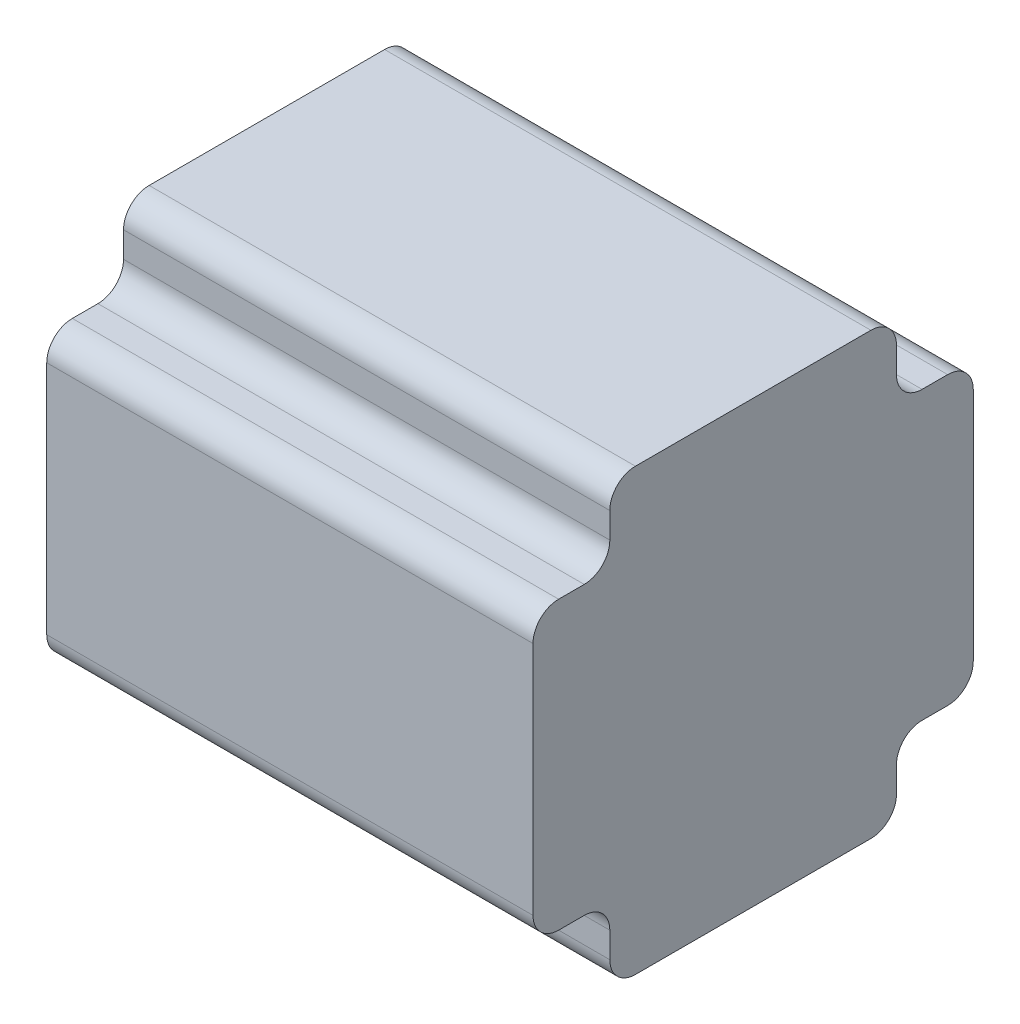
ISO-10303-21;
HEADER;
FILE_DESCRIPTION(('STEP AP214'),'2;1');
FILE_NAME('part.step','',(''),(''),'','','');
FILE_SCHEMA(('AUTOMOTIVE_DESIGN { 1 0 10303 214 1 1 1 1 }'));
ENDSEC;
DATA;
#1=APPLICATION_CONTEXT('core data for automotive mechanical design processes');
#2=APPLICATION_PROTOCOL_DEFINITION('international standard','automotive_design',2000,#1);
#3=PRODUCT_CONTEXT('',#1,'mechanical');
#4=PRODUCT('Part','Part','',(#3));
#5=PRODUCT_RELATED_PRODUCT_CATEGORY('part','',(#4));
#6=PRODUCT_DEFINITION_FORMATION('','',#4);
#7=PRODUCT_DEFINITION_CONTEXT('part definition',#1,'design');
#8=PRODUCT_DEFINITION('design','',#6,#7);
#9=PRODUCT_DEFINITION_SHAPE('','',#8);
#10=(LENGTH_UNIT() NAMED_UNIT(*) SI_UNIT(.MILLI.,.METRE.));
#11=(NAMED_UNIT(*) PLANE_ANGLE_UNIT() SI_UNIT($,.RADIAN.));
#12=(NAMED_UNIT(*) SI_UNIT($,.STERADIAN.) SOLID_ANGLE_UNIT());
#13=UNCERTAINTY_MEASURE_WITH_UNIT(LENGTH_MEASURE(1.E-05),#10,'distance_accuracy_value','');
#14=(GEOMETRIC_REPRESENTATION_CONTEXT(3) GLOBAL_UNCERTAINTY_ASSIGNED_CONTEXT((#13)) GLOBAL_UNIT_ASSIGNED_CONTEXT((#10,
#11,#12)) REPRESENTATION_CONTEXT('',''));
#15=CARTESIAN_POINT('',(0.,0.,0.));
#16=DIRECTION('',(0.,0.,1.));
#17=DIRECTION('',(1.,0.,0.));
#18=AXIS2_PLACEMENT_3D('',#15,#16,#17);
#19=CARTESIAN_POINT('',(95.,19.9999999999999,-81.));
#20=DIRECTION('',(-1.,0.,0.));
#21=DIRECTION('',(0.,0.,1.));
#22=AXIS2_PLACEMENT_3D('',#19,#20,#21);
#23=CYLINDRICAL_SURFACE('',#22,5.);
#24=CARTESIAN_POINT('',(0.,19.9999999999999,-81.));
#25=DIRECTION('',(1.,0.,0.));
#26=DIRECTION('',(0.,0.,-1.));
#27=AXIS2_PLACEMENT_3D('',#24,#25,#26);
#28=CIRCLE('',#27,5.);
#29=CARTESIAN_POINT('',(0.,14.9999999999999,-81.));
#30=VERTEX_POINT('',#29);
#31=CARTESIAN_POINT('',(0.,20.,-86.));
#32=VERTEX_POINT('',#31);
#33=EDGE_CURVE('E224',#30,#32,#28,.T.);
#34=ORIENTED_EDGE('',*,*,#33,.T.);
#35=DIRECTION('',(-1.,0.,0.));
#36=VECTOR('',#35,1.);
#37=CARTESIAN_POINT('',(95.,20.,-86.));
#38=LINE('',#37,#36);
#39=CARTESIAN_POINT('',(95.,20.,-86.));
#40=VERTEX_POINT('',#39);
#41=EDGE_CURVE('E11',#40,#32,#38,.T.);
#42=ORIENTED_EDGE('',*,*,#41,.F.);
#43=CARTESIAN_POINT('',(95.,19.9999999999999,-81.));
#44=DIRECTION('',(1.,0.,0.));
#45=DIRECTION('',(0.,0.,-1.));
#46=AXIS2_PLACEMENT_3D('',#43,#44,#45);
#47=CIRCLE('',#46,5.);
#48=CARTESIAN_POINT('',(95.,14.9999999999999,-81.));
#49=VERTEX_POINT('',#48);
#50=EDGE_CURVE('E270',#49,#40,#47,.T.);
#51=ORIENTED_EDGE('',*,*,#50,.F.);
#52=DIRECTION('',(-1.,0.,0.));
#53=VECTOR('',#52,1.);
#54=CARTESIAN_POINT('',(95.,14.9999999999999,-81.));
#55=LINE('',#54,#53);
#56=EDGE_CURVE('E220',#49,#30,#55,.T.);
#57=ORIENTED_EDGE('',*,*,#56,.T.);
#58=EDGE_LOOP('',(#34,#42,#51,#57));
#59=FACE_BOUND('',#58,.T.);
#60=ADVANCED_FACE('F32',(#59),#23,.T.);
#61=CARTESIAN_POINT('',(95.,20.,-86.));
#62=DIRECTION('',(0.,0.,1.));
#63=DIRECTION('',(1.,0.,0.));
#64=AXIS2_PLACEMENT_3D('',#61,#62,#63);
#65=PLANE('',#64);
#66=DIRECTION('',(0.,1.,0.));
#67=VECTOR('',#66,1.);
#68=CARTESIAN_POINT('',(0.,20.,-86.));
#69=LINE('',#68,#67);
#70=CARTESIAN_POINT('',(0.,65.9999999999999,-86.));
#71=VERTEX_POINT('',#70);
#72=EDGE_CURVE('E227',#32,#71,#69,.T.);
#73=ORIENTED_EDGE('',*,*,#72,.T.);
#74=DIRECTION('',(-1.,0.,0.));
#75=VECTOR('',#74,1.);
#76=CARTESIAN_POINT('',(95.,65.9999999999999,-86.));
#77=LINE('',#76,#75);
#78=CARTESIAN_POINT('',(95.,65.9999999999999,-86.));
#79=VERTEX_POINT('',#78);
#80=EDGE_CURVE('E40',#79,#71,#77,.T.);
#81=ORIENTED_EDGE('',*,*,#80,.F.);
#82=DIRECTION('',(0.,1.,0.));
#83=VECTOR('',#82,1.);
#84=CARTESIAN_POINT('',(95.,20.,-86.));
#85=LINE('',#84,#83);
#86=EDGE_CURVE('E139',#40,#79,#85,.T.);
#87=ORIENTED_EDGE('',*,*,#86,.F.);
#88=ORIENTED_EDGE('',*,*,#41,.T.);
#89=EDGE_LOOP('',(#73,#81,#87,#88));
#90=FACE_BOUND('',#89,.T.);
#91=ADVANCED_FACE('F408',(#90),#65,.F.);
#92=CARTESIAN_POINT('',(95.,65.9999999999999,-81.));
#93=DIRECTION('',(-1.,0.,0.));
#94=DIRECTION('',(0.,0.,1.));
#95=AXIS2_PLACEMENT_3D('',#92,#93,#94);
#96=CYLINDRICAL_SURFACE('',#95,5.);
#97=CARTESIAN_POINT('',(0.,65.9999999999999,-81.));
#98=DIRECTION('',(1.,0.,0.));
#99=DIRECTION('',(0.,0.,1.));
#100=AXIS2_PLACEMENT_3D('',#97,#98,#99);
#101=CIRCLE('',#100,5.);
#102=CARTESIAN_POINT('',(0.,70.9999999999999,-81.));
#103=VERTEX_POINT('',#102);
#104=EDGE_CURVE('E229',#71,#103,#101,.T.);
#105=ORIENTED_EDGE('',*,*,#104,.T.);
#106=DIRECTION('',(-1.,0.,0.));
#107=VECTOR('',#106,1.);
#108=CARTESIAN_POINT('',(95.,70.9999999999999,-81.));
#109=LINE('',#108,#107);
#110=CARTESIAN_POINT('',(95.,70.9999999999999,-81.));
#111=VERTEX_POINT('',#110);
#112=EDGE_CURVE('E325',#111,#103,#109,.T.);
#113=ORIENTED_EDGE('',*,*,#112,.F.);
#114=CARTESIAN_POINT('',(95.,65.9999999999999,-81.));
#115=DIRECTION('',(1.,0.,0.));
#116=DIRECTION('',(0.,0.,1.));
#117=AXIS2_PLACEMENT_3D('',#114,#115,#116);
#118=CIRCLE('',#117,5.);
#119=EDGE_CURVE('E333',#79,#111,#118,.T.);
#120=ORIENTED_EDGE('',*,*,#119,.F.);
#121=ORIENTED_EDGE('',*,*,#80,.T.);
#122=EDGE_LOOP('',(#105,#113,#120,#121));
#123=FACE_BOUND('',#122,.T.);
#124=ADVANCED_FACE('F331',(#123),#96,.T.);
#125=CARTESIAN_POINT('',(95.,70.9999999999999,-76.0000000000001));
#126=DIRECTION('',(0.,-1.,0.));
#127=DIRECTION('',(0.,0.,-1.));
#128=AXIS2_PLACEMENT_3D('',#125,#126,#127);
#129=PLANE('',#128);
#130=DIRECTION('',(0.,0.,1.));
#131=VECTOR('',#130,1.);
#132=CARTESIAN_POINT('',(0.,70.9999999999999,-76.0000000000001));
#133=LINE('',#132,#131);
#134=CARTESIAN_POINT('',(0.,70.9999999999999,-76.0000000000001));
#135=VERTEX_POINT('',#134);
#136=EDGE_CURVE('E231',#103,#135,#133,.T.);
#137=ORIENTED_EDGE('',*,*,#136,.T.);
#138=DIRECTION('',(-1.,0.,0.));
#139=VECTOR('',#138,1.);
#140=CARTESIAN_POINT('',(95.,70.9999999999999,-76.0000000000001));
#141=LINE('',#140,#139);
#142=CARTESIAN_POINT('',(95.,70.9999999999999,-76.0000000000001));
#143=VERTEX_POINT('',#142);
#144=EDGE_CURVE('E322',#143,#135,#141,.T.);
#145=ORIENTED_EDGE('',*,*,#144,.F.);
#146=DIRECTION('',(0.,0.,1.));
#147=VECTOR('',#146,1.);
#148=CARTESIAN_POINT('',(95.,70.9999999999999,-76.0000000000001));
#149=LINE('',#148,#147);
#150=EDGE_CURVE('E351',#111,#143,#149,.T.);
#151=ORIENTED_EDGE('',*,*,#150,.F.);
#152=ORIENTED_EDGE('',*,*,#112,.T.);
#153=EDGE_LOOP('',(#137,#145,#151,#152));
#154=FACE_BOUND('',#153,.T.);
#155=ADVANCED_FACE('F342',(#154),#129,.F.);
#156=CARTESIAN_POINT('',(95.,75.9999999999999,-76.));
#157=DIRECTION('',(-1.,0.,0.));
#158=DIRECTION('',(0.,0.,1.));
#159=AXIS2_PLACEMENT_3D('',#156,#157,#158);
#160=CYLINDRICAL_SURFACE('',#159,5.);
#161=CARTESIAN_POINT('',(0.,75.9999999999999,-76.));
#162=DIRECTION('',(-1.,0.,0.));
#163=DIRECTION('',(0.,0.,1.));
#164=AXIS2_PLACEMENT_3D('',#161,#162,#163);
#165=CIRCLE('',#164,5.);
#166=CARTESIAN_POINT('',(0.,75.9999999999999,-71.));
#167=VERTEX_POINT('',#166);
#168=EDGE_CURVE('E233',#135,#167,#165,.T.);
#169=ORIENTED_EDGE('',*,*,#168,.T.);
#170=DIRECTION('',(-1.,0.,0.));
#171=VECTOR('',#170,1.);
#172=CARTESIAN_POINT('',(95.,75.9999999999999,-71.));
#173=LINE('',#172,#171);
#174=CARTESIAN_POINT('',(95.,75.9999999999999,-71.));
#175=VERTEX_POINT('',#174);
#176=EDGE_CURVE('E319',#175,#167,#173,.T.);
#177=ORIENTED_EDGE('',*,*,#176,.F.);
#178=CARTESIAN_POINT('',(95.,75.9999999999999,-76.));
#179=DIRECTION('',(-1.,0.,0.));
#180=DIRECTION('',(0.,0.,1.));
#181=AXIS2_PLACEMENT_3D('',#178,#179,#180);
#182=CIRCLE('',#181,5.);
#183=EDGE_CURVE('E348',#143,#175,#182,.T.);
#184=ORIENTED_EDGE('',*,*,#183,.F.);
#185=ORIENTED_EDGE('',*,*,#144,.T.);
#186=EDGE_LOOP('',(#169,#177,#184,#185));
#187=FACE_BOUND('',#186,.T.);
#188=ADVANCED_FACE('F346',(#187),#160,.F.);
#189=CARTESIAN_POINT('',(95.,80.9999999999998,-71.));
#190=DIRECTION('',(0.,0.,1.));
#191=DIRECTION('',(1.,0.,0.));
#192=AXIS2_PLACEMENT_3D('',#189,#190,#191);
#193=PLANE('',#192);
#194=DIRECTION('',(0.,1.,0.));
#195=VECTOR('',#194,1.);
#196=CARTESIAN_POINT('',(0.,80.9999999999998,-71.));
#197=LINE('',#196,#195);
#198=CARTESIAN_POINT('',(0.,80.9999999999998,-71.));
#199=VERTEX_POINT('',#198);
#200=EDGE_CURVE('E235',#167,#199,#197,.T.);
#201=ORIENTED_EDGE('',*,*,#200,.T.);
#202=DIRECTION('',(-1.,0.,0.));
#203=VECTOR('',#202,1.);
#204=CARTESIAN_POINT('',(95.,80.9999999999998,-71.));
#205=LINE('',#204,#203);
#206=CARTESIAN_POINT('',(95.,80.9999999999998,-71.));
#207=VERTEX_POINT('',#206);
#208=EDGE_CURVE('E316',#207,#199,#205,.T.);
#209=ORIENTED_EDGE('',*,*,#208,.F.);
#210=DIRECTION('',(0.,1.,0.));
#211=VECTOR('',#210,1.);
#212=CARTESIAN_POINT('',(95.,80.9999999999998,-71.));
#213=LINE('',#212,#211);
#214=EDGE_CURVE('E350',#175,#207,#213,.T.);
#215=ORIENTED_EDGE('',*,*,#214,.F.);
#216=ORIENTED_EDGE('',*,*,#176,.T.);
#217=EDGE_LOOP('',(#201,#209,#215,#216));
#218=FACE_BOUND('',#217,.T.);
#219=ADVANCED_FACE('F421',(#218),#193,.F.);
#220=CARTESIAN_POINT('',(95.,80.9999999999999,-66.));
#221=DIRECTION('',(-1.,0.,0.));
#222=DIRECTION('',(0.,0.,1.));
#223=AXIS2_PLACEMENT_3D('',#220,#221,#222);
#224=CYLINDRICAL_SURFACE('',#223,5.);
#225=CARTESIAN_POINT('',(0.,80.9999999999999,-66.));
#226=DIRECTION('',(1.,0.,0.));
#227=DIRECTION('',(0.,0.,-1.));
#228=AXIS2_PLACEMENT_3D('',#225,#226,#227);
#229=CIRCLE('',#228,5.);
#230=CARTESIAN_POINT('',(0.,85.9999999999999,-66.));
#231=VERTEX_POINT('',#230);
#232=EDGE_CURVE('E237',#199,#231,#229,.T.);
#233=ORIENTED_EDGE('',*,*,#232,.T.);
#234=DIRECTION('',(-1.,0.,0.));
#235=VECTOR('',#234,1.);
#236=CARTESIAN_POINT('',(95.,85.9999999999999,-66.));
#237=LINE('',#236,#235);
#238=CARTESIAN_POINT('',(95.,85.9999999999999,-66.));
#239=VERTEX_POINT('',#238);
#240=EDGE_CURVE('E313',#239,#231,#237,.T.);
#241=ORIENTED_EDGE('',*,*,#240,.F.);
#242=CARTESIAN_POINT('',(95.,80.9999999999999,-66.));
#243=DIRECTION('',(1.,0.,0.));
#244=DIRECTION('',(0.,0.,-1.));
#245=AXIS2_PLACEMENT_3D('',#242,#243,#244);
#246=CIRCLE('',#245,5.);
#247=EDGE_CURVE('E353',#207,#239,#246,.T.);
#248=ORIENTED_EDGE('',*,*,#247,.F.);
#249=ORIENTED_EDGE('',*,*,#208,.T.);
#250=EDGE_LOOP('',(#233,#241,#248,#249));
#251=FACE_BOUND('',#250,.T.);
#252=ADVANCED_FACE('F424',(#251),#224,.T.);
#253=CARTESIAN_POINT('',(95.,85.9999999999999,-20.0000000000001));
#254=DIRECTION('',(0.,-1.,0.));
#255=DIRECTION('',(0.,0.,-1.));
#256=AXIS2_PLACEMENT_3D('',#253,#254,#255);
#257=PLANE('',#256);
#258=DIRECTION('',(0.,0.,1.));
#259=VECTOR('',#258,1.);
#260=CARTESIAN_POINT('',(0.,85.9999999999999,-20.0000000000001));
#261=LINE('',#260,#259);
#262=CARTESIAN_POINT('',(0.,85.9999999999999,-20.0000000000001));
#263=VERTEX_POINT('',#262);
#264=EDGE_CURVE('E239',#231,#263,#261,.T.);
#265=ORIENTED_EDGE('',*,*,#264,.T.);
#266=DIRECTION('',(-1.,0.,0.));
#267=VECTOR('',#266,1.);
#268=CARTESIAN_POINT('',(95.,85.9999999999999,-20.0000000000001));
#269=LINE('',#268,#267);
#270=CARTESIAN_POINT('',(95.,85.9999999999999,-20.0000000000001));
#271=VERTEX_POINT('',#270);
#272=EDGE_CURVE('E310',#271,#263,#269,.T.);
#273=ORIENTED_EDGE('',*,*,#272,.F.);
#274=DIRECTION('',(0.,0.,1.));
#275=VECTOR('',#274,1.);
#276=CARTESIAN_POINT('',(95.,85.9999999999999,-20.0000000000001));
#277=LINE('',#276,#275);
#278=EDGE_CURVE('E359',#239,#271,#277,.T.);
#279=ORIENTED_EDGE('',*,*,#278,.F.);
#280=ORIENTED_EDGE('',*,*,#240,.T.);
#281=EDGE_LOOP('',(#265,#273,#279,#280));
#282=FACE_BOUND('',#281,.T.);
#283=ADVANCED_FACE('F428',(#282),#257,.F.);
#284=CARTESIAN_POINT('',(95.,80.9999999999999,-20.));
#285=DIRECTION('',(-1.,0.,0.));
#286=DIRECTION('',(0.,0.,1.));
#287=AXIS2_PLACEMENT_3D('',#284,#285,#286);
#288=CYLINDRICAL_SURFACE('',#287,5.);
#289=CARTESIAN_POINT('',(0.,80.9999999999999,-20.));
#290=DIRECTION('',(1.,0.,0.));
#291=DIRECTION('',(0.,0.,1.));
#292=AXIS2_PLACEMENT_3D('',#289,#290,#291);
#293=CIRCLE('',#292,5.);
#294=CARTESIAN_POINT('',(0.,80.9999999999998,-15.));
#295=VERTEX_POINT('',#294);
#296=EDGE_CURVE('E241',#263,#295,#293,.T.);
#297=ORIENTED_EDGE('',*,*,#296,.T.);
#298=DIRECTION('',(-1.,0.,0.));
#299=VECTOR('',#298,1.);
#300=CARTESIAN_POINT('',(95.,80.9999999999998,-15.));
#301=LINE('',#300,#299);
#302=CARTESIAN_POINT('',(95.,80.9999999999998,-15.));
#303=VERTEX_POINT('',#302);
#304=EDGE_CURVE('E307',#303,#295,#301,.T.);
#305=ORIENTED_EDGE('',*,*,#304,.F.);
#306=CARTESIAN_POINT('',(95.,80.9999999999999,-20.));
#307=DIRECTION('',(1.,0.,0.));
#308=DIRECTION('',(0.,0.,1.));
#309=AXIS2_PLACEMENT_3D('',#306,#307,#308);
#310=CIRCLE('',#309,5.);
#311=EDGE_CURVE('E361',#271,#303,#310,.T.);
#312=ORIENTED_EDGE('',*,*,#311,.F.);
#313=ORIENTED_EDGE('',*,*,#272,.T.);
#314=EDGE_LOOP('',(#297,#305,#312,#313));
#315=FACE_BOUND('',#314,.T.);
#316=ADVANCED_FACE('F432',(#315),#288,.T.);
#317=CARTESIAN_POINT('',(95.,80.9999999999998,-15.));
#318=DIRECTION('',(0.,0.,-1.));
#319=DIRECTION('',(0.,1.,0.));
#320=AXIS2_PLACEMENT_3D('',#317,#318,#319);
#321=PLANE('',#320);
#322=DIRECTION('',(0.,-1.,0.));
#323=VECTOR('',#322,1.);
#324=CARTESIAN_POINT('',(0.,80.9999999999998,-15.));
#325=LINE('',#324,#323);
#326=CARTESIAN_POINT('',(0.,75.9999999999999,-15.));
#327=VERTEX_POINT('',#326);
#328=EDGE_CURVE('E243',#295,#327,#325,.T.);
#329=ORIENTED_EDGE('',*,*,#328,.T.);
#330=DIRECTION('',(-1.,0.,0.));
#331=VECTOR('',#330,1.);
#332=CARTESIAN_POINT('',(95.,75.9999999999999,-15.));
#333=LINE('',#332,#331);
#334=CARTESIAN_POINT('',(95.,75.9999999999999,-15.));
#335=VERTEX_POINT('',#334);
#336=EDGE_CURVE('E304',#335,#327,#333,.T.);
#337=ORIENTED_EDGE('',*,*,#336,.F.);
#338=DIRECTION('',(0.,-1.,0.));
#339=VECTOR('',#338,1.);
#340=CARTESIAN_POINT('',(95.,80.9999999999998,-15.));
#341=LINE('',#340,#339);
#342=EDGE_CURVE('E363',#303,#335,#341,.T.);
#343=ORIENTED_EDGE('',*,*,#342,.F.);
#344=ORIENTED_EDGE('',*,*,#304,.T.);
#345=EDGE_LOOP('',(#329,#337,#343,#344));
#346=FACE_BOUND('',#345,.T.);
#347=ADVANCED_FACE('F436',(#346),#321,.F.);
#348=CARTESIAN_POINT('',(95.,75.9999999999999,-10.));
#349=DIRECTION('',(-1.,0.,0.));
#350=DIRECTION('',(0.,0.,1.));
#351=AXIS2_PLACEMENT_3D('',#348,#349,#350);
#352=CYLINDRICAL_SURFACE('',#351,5.);
#353=CARTESIAN_POINT('',(0.,75.9999999999999,-10.));
#354=DIRECTION('',(-1.,0.,0.));
#355=DIRECTION('',(0.,0.,1.));
#356=AXIS2_PLACEMENT_3D('',#353,#354,#355);
#357=CIRCLE('',#356,5.);
#358=CARTESIAN_POINT('',(0.,70.9999999999999,-9.99999999999996));
#359=VERTEX_POINT('',#358);
#360=EDGE_CURVE('E245',#327,#359,#357,.T.);
#361=ORIENTED_EDGE('',*,*,#360,.T.);
#362=DIRECTION('',(-1.,0.,0.));
#363=VECTOR('',#362,1.);
#364=CARTESIAN_POINT('',(95.,70.9999999999999,-9.99999999999996));
#365=LINE('',#364,#363);
#366=CARTESIAN_POINT('',(95.,70.9999999999999,-9.99999999999996));
#367=VERTEX_POINT('',#366);
#368=EDGE_CURVE('E301',#367,#359,#365,.T.);
#369=ORIENTED_EDGE('',*,*,#368,.F.);
#370=CARTESIAN_POINT('',(95.,75.9999999999999,-10.));
#371=DIRECTION('',(-1.,0.,0.));
#372=DIRECTION('',(0.,0.,1.));
#373=AXIS2_PLACEMENT_3D('',#370,#371,#372);
#374=CIRCLE('',#373,5.);
#375=EDGE_CURVE('E365',#335,#367,#374,.T.);
#376=ORIENTED_EDGE('',*,*,#375,.F.);
#377=ORIENTED_EDGE('',*,*,#336,.T.);
#378=EDGE_LOOP('',(#361,#369,#376,#377));
#379=FACE_BOUND('',#378,.T.);
#380=ADVANCED_FACE('F440',(#379),#352,.F.);
#381=CARTESIAN_POINT('',(95.,70.9999999999999,-9.99999999999996));
#382=DIRECTION('',(0.,-1.,0.));
#383=DIRECTION('',(0.,0.,-1.));
#384=AXIS2_PLACEMENT_3D('',#381,#382,#383);
#385=PLANE('',#384);
#386=DIRECTION('',(0.,0.,1.));
#387=VECTOR('',#386,1.);
#388=CARTESIAN_POINT('',(0.,70.9999999999999,-9.99999999999996));
#389=LINE('',#388,#387);
#390=CARTESIAN_POINT('',(0.,70.9999999999999,-5.00000000000005));
#391=VERTEX_POINT('',#390);
#392=EDGE_CURVE('E247',#359,#391,#389,.T.);
#393=ORIENTED_EDGE('',*,*,#392,.T.);
#394=DIRECTION('',(-1.,0.,0.));
#395=VECTOR('',#394,1.);
#396=CARTESIAN_POINT('',(95.,70.9999999999999,-5.00000000000005));
#397=LINE('',#396,#395);
#398=CARTESIAN_POINT('',(95.,70.9999999999999,-5.00000000000005));
#399=VERTEX_POINT('',#398);
#400=EDGE_CURVE('E298',#399,#391,#397,.T.);
#401=ORIENTED_EDGE('',*,*,#400,.F.);
#402=DIRECTION('',(0.,0.,1.));
#403=VECTOR('',#402,1.);
#404=CARTESIAN_POINT('',(95.,70.9999999999999,-9.99999999999996));
#405=LINE('',#404,#403);
#406=EDGE_CURVE('E367',#367,#399,#405,.T.);
#407=ORIENTED_EDGE('',*,*,#406,.F.);
#408=ORIENTED_EDGE('',*,*,#368,.T.);
#409=EDGE_LOOP('',(#393,#401,#407,#408));
#410=FACE_BOUND('',#409,.T.);
#411=ADVANCED_FACE('F444',(#410),#385,.F.);
#412=CARTESIAN_POINT('',(95.,65.9999999999999,-5.));
#413=DIRECTION('',(-1.,0.,0.));
#414=DIRECTION('',(0.,0.,1.));
#415=AXIS2_PLACEMENT_3D('',#412,#413,#414);
#416=CYLINDRICAL_SURFACE('',#415,5.);
#417=CARTESIAN_POINT('',(0.,65.9999999999999,-5.));
#418=DIRECTION('',(1.,0.,0.));
#419=DIRECTION('',(0.,0.,-1.));
#420=AXIS2_PLACEMENT_3D('',#417,#418,#419);
#421=CIRCLE('',#420,5.);
#422=CARTESIAN_POINT('',(0.,65.9999999999999,0.));
#423=VERTEX_POINT('',#422);
#424=EDGE_CURVE('E249',#391,#423,#421,.T.);
#425=ORIENTED_EDGE('',*,*,#424,.T.);
#426=DIRECTION('',(-1.,0.,0.));
#427=VECTOR('',#426,1.);
#428=CARTESIAN_POINT('',(95.,65.9999999999999,0.));
#429=LINE('',#428,#427);
#430=CARTESIAN_POINT('',(95.,65.9999999999999,0.));
#431=VERTEX_POINT('',#430);
#432=EDGE_CURVE('E295',#431,#423,#429,.T.);
#433=ORIENTED_EDGE('',*,*,#432,.F.);
#434=CARTESIAN_POINT('',(95.,65.9999999999999,-5.));
#435=DIRECTION('',(1.,0.,0.));
#436=DIRECTION('',(0.,0.,-1.));
#437=AXIS2_PLACEMENT_3D('',#434,#435,#436);
#438=CIRCLE('',#437,5.);
#439=EDGE_CURVE('E369',#399,#431,#438,.T.);
#440=ORIENTED_EDGE('',*,*,#439,.F.);
#441=ORIENTED_EDGE('',*,*,#400,.T.);
#442=EDGE_LOOP('',(#425,#433,#440,#441));
#443=FACE_BOUND('',#442,.T.);
#444=ADVANCED_FACE('F448',(#443),#416,.T.);
#445=CARTESIAN_POINT('',(95.,20.,0.));
#446=DIRECTION('',(0.,0.,-1.));
#447=DIRECTION('',(0.,1.,0.));
#448=AXIS2_PLACEMENT_3D('',#445,#446,#447);
#449=PLANE('',#448);
#450=DIRECTION('',(0.,-1.,0.));
#451=VECTOR('',#450,1.);
#452=CARTESIAN_POINT('',(0.,20.,0.));
#453=LINE('',#452,#451);
#454=CARTESIAN_POINT('',(0.,20.,0.));
#455=VERTEX_POINT('',#454);
#456=EDGE_CURVE('E251',#423,#455,#453,.T.);
#457=ORIENTED_EDGE('',*,*,#456,.T.);
#458=DIRECTION('',(-1.,0.,0.));
#459=VECTOR('',#458,1.);
#460=CARTESIAN_POINT('',(95.,20.,0.));
#461=LINE('',#460,#459);
#462=CARTESIAN_POINT('',(95.,20.,0.));
#463=VERTEX_POINT('',#462);
#464=EDGE_CURVE('E292',#463,#455,#461,.T.);
#465=ORIENTED_EDGE('',*,*,#464,.F.);
#466=DIRECTION('',(0.,-1.,0.));
#467=VECTOR('',#466,1.);
#468=CARTESIAN_POINT('',(95.,20.,0.));
#469=LINE('',#468,#467);
#470=EDGE_CURVE('E371',#431,#463,#469,.T.);
#471=ORIENTED_EDGE('',*,*,#470,.F.);
#472=ORIENTED_EDGE('',*,*,#432,.T.);
#473=EDGE_LOOP('',(#457,#465,#471,#472));
#474=FACE_BOUND('',#473,.T.);
#475=ADVANCED_FACE('F452',(#474),#449,.F.);
#476=CARTESIAN_POINT('',(95.,20.,-5.));
#477=DIRECTION('',(-1.,0.,0.));
#478=DIRECTION('',(0.,0.,1.));
#479=AXIS2_PLACEMENT_3D('',#476,#477,#478);
#480=CYLINDRICAL_SURFACE('',#479,5.);
#481=CARTESIAN_POINT('',(0.,20.,-5.));
#482=DIRECTION('',(1.,0.,0.));
#483=DIRECTION('',(0.,0.,1.));
#484=AXIS2_PLACEMENT_3D('',#481,#482,#483);
#485=CIRCLE('',#484,5.);
#486=CARTESIAN_POINT('',(0.,15.,-5.00000000000004));
#487=VERTEX_POINT('',#486);
#488=EDGE_CURVE('E253',#455,#487,#485,.T.);
#489=ORIENTED_EDGE('',*,*,#488,.T.);
#490=DIRECTION('',(-1.,0.,0.));
#491=VECTOR('',#490,1.);
#492=CARTESIAN_POINT('',(95.,15.,-5.00000000000004));
#493=LINE('',#492,#491);
#494=CARTESIAN_POINT('',(95.,15.,-5.00000000000004));
#495=VERTEX_POINT('',#494);
#496=EDGE_CURVE('E289',#495,#487,#493,.T.);
#497=ORIENTED_EDGE('',*,*,#496,.F.);
#498=CARTESIAN_POINT('',(95.,20.,-5.));
#499=DIRECTION('',(1.,0.,0.));
#500=DIRECTION('',(0.,0.,1.));
#501=AXIS2_PLACEMENT_3D('',#498,#499,#500);
#502=CIRCLE('',#501,5.);
#503=EDGE_CURVE('E373',#463,#495,#502,.T.);
#504=ORIENTED_EDGE('',*,*,#503,.F.);
#505=ORIENTED_EDGE('',*,*,#464,.T.);
#506=EDGE_LOOP('',(#489,#497,#504,#505));
#507=FACE_BOUND('',#506,.T.);
#508=ADVANCED_FACE('F456',(#507),#480,.T.);
#509=CARTESIAN_POINT('',(95.,15.,-9.99999999999996));
#510=DIRECTION('',(0.,1.,0.));
#511=DIRECTION('',(0.,0.,1.));
#512=AXIS2_PLACEMENT_3D('',#509,#510,#511);
#513=PLANE('',#512);
#514=DIRECTION('',(0.,0.,-1.));
#515=VECTOR('',#514,1.);
#516=CARTESIAN_POINT('',(0.,15.,-9.99999999999996));
#517=LINE('',#516,#515);
#518=CARTESIAN_POINT('',(0.,15.,-9.99999999999996));
#519=VERTEX_POINT('',#518);
#520=EDGE_CURVE('E255',#487,#519,#517,.T.);
#521=ORIENTED_EDGE('',*,*,#520,.T.);
#522=DIRECTION('',(-1.,0.,0.));
#523=VECTOR('',#522,1.);
#524=CARTESIAN_POINT('',(95.,15.,-9.99999999999996));
#525=LINE('',#524,#523);
#526=CARTESIAN_POINT('',(95.,15.,-9.99999999999996));
#527=VERTEX_POINT('',#526);
#528=EDGE_CURVE('E286',#527,#519,#525,.T.);
#529=ORIENTED_EDGE('',*,*,#528,.F.);
#530=DIRECTION('',(0.,0.,-1.));
#531=VECTOR('',#530,1.);
#532=CARTESIAN_POINT('',(95.,15.,-9.99999999999996));
#533=LINE('',#532,#531);
#534=EDGE_CURVE('E375',#495,#527,#533,.T.);
#535=ORIENTED_EDGE('',*,*,#534,.F.);
#536=ORIENTED_EDGE('',*,*,#496,.T.);
#537=EDGE_LOOP('',(#521,#529,#535,#536));
#538=FACE_BOUND('',#537,.T.);
#539=ADVANCED_FACE('F460',(#538),#513,.F.);
#540=CARTESIAN_POINT('',(95.,9.99999999999996,-9.99999999999999));
#541=DIRECTION('',(-1.,0.,0.));
#542=DIRECTION('',(0.,0.,1.));
#543=AXIS2_PLACEMENT_3D('',#540,#541,#542);
#544=CYLINDRICAL_SURFACE('',#543,5.);
#545=CARTESIAN_POINT('',(0.,9.99999999999996,-9.99999999999999));
#546=DIRECTION('',(-1.,0.,0.));
#547=DIRECTION('',(0.,0.,-1.));
#548=AXIS2_PLACEMENT_3D('',#545,#546,#547);
#549=CIRCLE('',#548,5.);
#550=CARTESIAN_POINT('',(0.,9.99999999999991,-15.));
#551=VERTEX_POINT('',#550);
#552=EDGE_CURVE('E257',#519,#551,#549,.T.);
#553=ORIENTED_EDGE('',*,*,#552,.T.);
#554=DIRECTION('',(-1.,0.,0.));
#555=VECTOR('',#554,1.);
#556=CARTESIAN_POINT('',(95.,9.99999999999991,-15.));
#557=LINE('',#556,#555);
#558=CARTESIAN_POINT('',(95.,9.99999999999991,-15.));
#559=VERTEX_POINT('',#558);
#560=EDGE_CURVE('E283',#559,#551,#557,.T.);
#561=ORIENTED_EDGE('',*,*,#560,.F.);
#562=CARTESIAN_POINT('',(95.,9.99999999999996,-9.99999999999999));
#563=DIRECTION('',(-1.,0.,0.));
#564=DIRECTION('',(0.,0.,-1.));
#565=AXIS2_PLACEMENT_3D('',#562,#563,#564);
#566=CIRCLE('',#565,5.);
#567=EDGE_CURVE('E377',#527,#559,#566,.T.);
#568=ORIENTED_EDGE('',*,*,#567,.F.);
#569=ORIENTED_EDGE('',*,*,#528,.T.);
#570=EDGE_LOOP('',(#553,#561,#568,#569));
#571=FACE_BOUND('',#570,.T.);
#572=ADVANCED_FACE('F464',(#571),#544,.F.);
#573=CARTESIAN_POINT('',(95.,5.00000000000004,-15.));
#574=DIRECTION('',(0.,0.,-1.));
#575=DIRECTION('',(0.,1.,0.));
#576=AXIS2_PLACEMENT_3D('',#573,#574,#575);
#577=PLANE('',#576);
#578=DIRECTION('',(0.,-1.,0.));
#579=VECTOR('',#578,1.);
#580=CARTESIAN_POINT('',(0.,5.00000000000004,-15.));
#581=LINE('',#580,#579);
#582=CARTESIAN_POINT('',(0.,5.00000000000004,-15.));
#583=VERTEX_POINT('',#582);
#584=EDGE_CURVE('E259',#551,#583,#581,.T.);
#585=ORIENTED_EDGE('',*,*,#584,.T.);
#586=DIRECTION('',(-1.,0.,0.));
#587=VECTOR('',#586,1.);
#588=CARTESIAN_POINT('',(95.,5.00000000000004,-15.));
#589=LINE('',#588,#587);
#590=CARTESIAN_POINT('',(95.,5.00000000000004,-15.));
#591=VERTEX_POINT('',#590);
#592=EDGE_CURVE('E280',#591,#583,#589,.T.);
#593=ORIENTED_EDGE('',*,*,#592,.F.);
#594=DIRECTION('',(0.,-1.,0.));
#595=VECTOR('',#594,1.);
#596=CARTESIAN_POINT('',(95.,5.00000000000004,-15.));
#597=LINE('',#596,#595);
#598=EDGE_CURVE('E379',#559,#591,#597,.T.);
#599=ORIENTED_EDGE('',*,*,#598,.F.);
#600=ORIENTED_EDGE('',*,*,#560,.T.);
#601=EDGE_LOOP('',(#585,#593,#599,#600));
#602=FACE_BOUND('',#601,.T.);
#603=ADVANCED_FACE('F468',(#602),#577,.F.);
#604=CARTESIAN_POINT('',(95.,5.,-20.));
#605=DIRECTION('',(-1.,0.,0.));
#606=DIRECTION('',(0.,0.,1.));
#607=AXIS2_PLACEMENT_3D('',#604,#605,#606);
#608=CYLINDRICAL_SURFACE('',#607,5.);
#609=CARTESIAN_POINT('',(0.,5.,-20.));
#610=DIRECTION('',(1.,0.,0.));
#611=DIRECTION('',(0.,0.,-1.));
#612=AXIS2_PLACEMENT_3D('',#609,#610,#611);
#613=CIRCLE('',#612,5.);
#614=CARTESIAN_POINT('',(0.,0.,-20.));
#615=VERTEX_POINT('',#614);
#616=EDGE_CURVE('E261',#583,#615,#613,.T.);
#617=ORIENTED_EDGE('',*,*,#616,.T.);
#618=DIRECTION('',(-1.,0.,0.));
#619=VECTOR('',#618,1.);
#620=CARTESIAN_POINT('',(95.,0.,-20.));
#621=LINE('',#620,#619);
#622=CARTESIAN_POINT('',(95.,0.,-20.));
#623=VERTEX_POINT('',#622);
#624=EDGE_CURVE('E277',#623,#615,#621,.T.);
#625=ORIENTED_EDGE('',*,*,#624,.F.);
#626=CARTESIAN_POINT('',(95.,5.,-20.));
#627=DIRECTION('',(1.,0.,0.));
#628=DIRECTION('',(0.,0.,-1.));
#629=AXIS2_PLACEMENT_3D('',#626,#627,#628);
#630=CIRCLE('',#629,5.);
#631=EDGE_CURVE('E381',#591,#623,#630,.T.);
#632=ORIENTED_EDGE('',*,*,#631,.F.);
#633=ORIENTED_EDGE('',*,*,#592,.T.);
#634=EDGE_LOOP('',(#617,#625,#632,#633));
#635=FACE_BOUND('',#634,.T.);
#636=ADVANCED_FACE('F472',(#635),#608,.T.);
#637=CARTESIAN_POINT('',(95.,0.,-20.));
#638=DIRECTION('',(0.,1.,0.));
#639=DIRECTION('',(0.,0.,1.));
#640=AXIS2_PLACEMENT_3D('',#637,#638,#639);
#641=PLANE('',#640);
#642=DIRECTION('',(0.,0.,-1.));
#643=VECTOR('',#642,1.);
#644=CARTESIAN_POINT('',(0.,0.,-20.));
#645=LINE('',#644,#643);
#646=CARTESIAN_POINT('',(0.,0.,-66.));
#647=VERTEX_POINT('',#646);
#648=EDGE_CURVE('E263',#615,#647,#645,.T.);
#649=ORIENTED_EDGE('',*,*,#648,.T.);
#650=DIRECTION('',(-1.,0.,0.));
#651=VECTOR('',#650,1.);
#652=CARTESIAN_POINT('',(95.,0.,-66.));
#653=LINE('',#652,#651);
#654=CARTESIAN_POINT('',(95.,0.,-66.));
#655=VERTEX_POINT('',#654);
#656=EDGE_CURVE('E274',#655,#647,#653,.T.);
#657=ORIENTED_EDGE('',*,*,#656,.F.);
#658=DIRECTION('',(0.,0.,-1.));
#659=VECTOR('',#658,1.);
#660=CARTESIAN_POINT('',(95.,0.,-20.));
#661=LINE('',#660,#659);
#662=EDGE_CURVE('E383',#623,#655,#661,.T.);
#663=ORIENTED_EDGE('',*,*,#662,.F.);
#664=ORIENTED_EDGE('',*,*,#624,.T.);
#665=EDGE_LOOP('',(#649,#657,#663,#664));
#666=FACE_BOUND('',#665,.T.);
#667=ADVANCED_FACE('F389',(#666),#641,.F.);
#668=CARTESIAN_POINT('',(95.,5.00000000000002,-66.));
#669=DIRECTION('',(-1.,0.,0.));
#670=DIRECTION('',(0.,0.,1.));
#671=AXIS2_PLACEMENT_3D('',#668,#669,#670);
#672=CYLINDRICAL_SURFACE('',#671,5.);
#673=CARTESIAN_POINT('',(0.,5.00000000000002,-66.));
#674=DIRECTION('',(1.,0.,0.));
#675=DIRECTION('',(0.,0.,1.));
#676=AXIS2_PLACEMENT_3D('',#673,#674,#675);
#677=CIRCLE('',#676,5.);
#678=CARTESIAN_POINT('',(0.,5.00000000000004,-71.));
#679=VERTEX_POINT('',#678);
#680=EDGE_CURVE('E265',#647,#679,#677,.T.);
#681=ORIENTED_EDGE('',*,*,#680,.T.);
#682=DIRECTION('',(-1.,0.,0.));
#683=VECTOR('',#682,1.);
#684=CARTESIAN_POINT('',(95.,5.00000000000004,-71.));
#685=LINE('',#684,#683);
#686=CARTESIAN_POINT('',(95.,5.00000000000004,-71.));
#687=VERTEX_POINT('',#686);
#688=EDGE_CURVE('E215',#687,#679,#685,.T.);
#689=ORIENTED_EDGE('',*,*,#688,.F.);
#690=CARTESIAN_POINT('',(95.,5.00000000000002,-66.));
#691=DIRECTION('',(1.,0.,0.));
#692=DIRECTION('',(0.,0.,1.));
#693=AXIS2_PLACEMENT_3D('',#690,#691,#692);
#694=CIRCLE('',#693,5.);
#695=EDGE_CURVE('E206',#655,#687,#694,.T.);
#696=ORIENTED_EDGE('',*,*,#695,.F.);
#697=ORIENTED_EDGE('',*,*,#656,.T.);
#698=EDGE_LOOP('',(#681,#689,#696,#697));
#699=FACE_BOUND('',#698,.T.);
#700=ADVANCED_FACE('F393',(#699),#672,.T.);
#701=CARTESIAN_POINT('',(95.,5.00000000000004,-71.));
#702=DIRECTION('',(0.,0.,1.));
#703=DIRECTION('',(0.,-1.,0.));
#704=AXIS2_PLACEMENT_3D('',#701,#702,#703);
#705=PLANE('',#704);
#706=DIRECTION('',(0.,1.,0.));
#707=VECTOR('',#706,1.);
#708=CARTESIAN_POINT('',(0.,5.00000000000004,-71.));
#709=LINE('',#708,#707);
#710=CARTESIAN_POINT('',(0.,9.99999999999992,-71.));
#711=VERTEX_POINT('',#710);
#712=EDGE_CURVE('E214',#679,#711,#709,.T.);
#713=ORIENTED_EDGE('',*,*,#712,.T.);
#714=DIRECTION('',(-1.,0.,0.));
#715=VECTOR('',#714,1.);
#716=CARTESIAN_POINT('',(95.,9.99999999999992,-71.));
#717=LINE('',#716,#715);
#718=CARTESIAN_POINT('',(95.,9.99999999999992,-71.));
#719=VERTEX_POINT('',#718);
#720=EDGE_CURVE('E211',#719,#711,#717,.T.);
#721=ORIENTED_EDGE('',*,*,#720,.F.);
#722=DIRECTION('',(0.,1.,0.));
#723=VECTOR('',#722,1.);
#724=CARTESIAN_POINT('',(95.,5.00000000000004,-71.));
#725=LINE('',#724,#723);
#726=EDGE_CURVE('E200',#687,#719,#725,.T.);
#727=ORIENTED_EDGE('',*,*,#726,.F.);
#728=ORIENTED_EDGE('',*,*,#688,.T.);
#729=EDGE_LOOP('',(#713,#721,#727,#728));
#730=FACE_BOUND('',#729,.T.);
#731=ADVANCED_FACE('F212',(#730),#705,.F.);
#732=CARTESIAN_POINT('',(95.,9.99999999999994,-76.));
#733=DIRECTION('',(-1.,0.,0.));
#734=DIRECTION('',(0.,0.,1.));
#735=AXIS2_PLACEMENT_3D('',#732,#733,#734);
#736=CYLINDRICAL_SURFACE('',#735,5.);
#737=CARTESIAN_POINT('',(0.,9.99999999999994,-76.));
#738=DIRECTION('',(-1.,0.,0.));
#739=DIRECTION('',(0.,0.,-1.));
#740=AXIS2_PLACEMENT_3D('',#737,#738,#739);
#741=CIRCLE('',#740,5.);
#742=CARTESIAN_POINT('',(0.,14.9999999999999,-76.0000000000001));
#743=VERTEX_POINT('',#742);
#744=EDGE_CURVE('E125',#711,#743,#741,.T.);
#745=ORIENTED_EDGE('',*,*,#744,.T.);
#746=DIRECTION('',(-1.,0.,0.));
#747=VECTOR('',#746,1.);
#748=CARTESIAN_POINT('',(95.,14.9999999999999,-76.0000000000001));
#749=LINE('',#748,#747);
#750=CARTESIAN_POINT('',(95.,14.9999999999999,-76.0000000000001));
#751=VERTEX_POINT('',#750);
#752=EDGE_CURVE('E216',#751,#743,#749,.T.);
#753=ORIENTED_EDGE('',*,*,#752,.F.);
#754=CARTESIAN_POINT('',(95.,9.99999999999994,-76.));
#755=DIRECTION('',(-1.,0.,0.));
#756=DIRECTION('',(0.,0.,-1.));
#757=AXIS2_PLACEMENT_3D('',#754,#755,#756);
#758=CIRCLE('',#757,5.);
#759=EDGE_CURVE('E204',#719,#751,#758,.T.);
#760=ORIENTED_EDGE('',*,*,#759,.F.);
#761=ORIENTED_EDGE('',*,*,#720,.T.);
#762=EDGE_LOOP('',(#745,#753,#760,#761));
#763=FACE_BOUND('',#762,.T.);
#764=ADVANCED_FACE('F218',(#763),#736,.F.);
#765=CARTESIAN_POINT('',(95.,14.9999999999999,-76.0000000000001));
#766=DIRECTION('',(0.,1.,0.));
#767=DIRECTION('',(0.,0.,1.));
#768=AXIS2_PLACEMENT_3D('',#765,#766,#767);
#769=PLANE('',#768);
#770=DIRECTION('',(0.,0.,-1.));
#771=VECTOR('',#770,1.);
#772=CARTESIAN_POINT('',(0.,14.9999999999999,-76.0000000000001));
#773=LINE('',#772,#771);
#774=EDGE_CURVE('E131',#743,#30,#773,.T.);
#775=ORIENTED_EDGE('',*,*,#774,.T.);
#776=ORIENTED_EDGE('',*,*,#56,.F.);
#777=DIRECTION('',(0.,0.,-1.));
#778=VECTOR('',#777,1.);
#779=CARTESIAN_POINT('',(95.,14.9999999999999,-76.0000000000001));
#780=LINE('',#779,#778);
#781=EDGE_CURVE('E48',#751,#49,#780,.T.);
#782=ORIENTED_EDGE('',*,*,#781,.F.);
#783=ORIENTED_EDGE('',*,*,#752,.T.);
#784=EDGE_LOOP('',(#775,#776,#782,#783));
#785=FACE_BOUND('',#784,.T.);
#786=ADVANCED_FACE('F397',(#785),#769,.F.);
#787=CARTESIAN_POINT('',(95.,19.9999999999999,-81.));
#788=DIRECTION('',(1.,0.,0.));
#789=DIRECTION('',(0.,0.,-1.));
#790=AXIS2_PLACEMENT_3D('',#787,#788,#789);
#791=PLANE('',#790);
#792=ORIENTED_EDGE('',*,*,#50,.T.);
#793=ORIENTED_EDGE('',*,*,#86,.T.);
#794=ORIENTED_EDGE('',*,*,#119,.T.);
#795=ORIENTED_EDGE('',*,*,#150,.T.);
#796=ORIENTED_EDGE('',*,*,#183,.T.);
#797=ORIENTED_EDGE('',*,*,#214,.T.);
#798=ORIENTED_EDGE('',*,*,#247,.T.);
#799=ORIENTED_EDGE('',*,*,#278,.T.);
#800=ORIENTED_EDGE('',*,*,#311,.T.);
#801=ORIENTED_EDGE('',*,*,#342,.T.);
#802=ORIENTED_EDGE('',*,*,#375,.T.);
#803=ORIENTED_EDGE('',*,*,#406,.T.);
#804=ORIENTED_EDGE('',*,*,#439,.T.);
#805=ORIENTED_EDGE('',*,*,#470,.T.);
#806=ORIENTED_EDGE('',*,*,#503,.T.);
#807=ORIENTED_EDGE('',*,*,#534,.T.);
#808=ORIENTED_EDGE('',*,*,#567,.T.);
#809=ORIENTED_EDGE('',*,*,#598,.T.);
#810=ORIENTED_EDGE('',*,*,#631,.T.);
#811=ORIENTED_EDGE('',*,*,#662,.T.);
#812=ORIENTED_EDGE('',*,*,#695,.T.);
#813=ORIENTED_EDGE('',*,*,#726,.T.);
#814=ORIENTED_EDGE('',*,*,#759,.T.);
#815=ORIENTED_EDGE('',*,*,#781,.T.);
#816=EDGE_LOOP('',(#792,#793,#794,#795,#796,#797,#798,#799,#800,#801,#802,#803,#804,#805,#806,
#807,#808,#809,#810,#811,#812,#813,#814,#815));
#817=FACE_BOUND('',#816,.T.);
#818=ADVANCED_FACE('F202',(#817),#791,.T.);
#819=CARTESIAN_POINT('',(0.,19.9999999999999,-81.));
#820=DIRECTION('',(1.,0.,0.));
#821=DIRECTION('',(0.,0.,-1.));
#822=AXIS2_PLACEMENT_3D('',#819,#820,#821);
#823=PLANE('',#822);
#824=ORIENTED_EDGE('',*,*,#33,.F.);
#825=ORIENTED_EDGE('',*,*,#774,.F.);
#826=ORIENTED_EDGE('',*,*,#744,.F.);
#827=ORIENTED_EDGE('',*,*,#712,.F.);
#828=ORIENTED_EDGE('',*,*,#680,.F.);
#829=ORIENTED_EDGE('',*,*,#648,.F.);
#830=ORIENTED_EDGE('',*,*,#616,.F.);
#831=ORIENTED_EDGE('',*,*,#584,.F.);
#832=ORIENTED_EDGE('',*,*,#552,.F.);
#833=ORIENTED_EDGE('',*,*,#520,.F.);
#834=ORIENTED_EDGE('',*,*,#488,.F.);
#835=ORIENTED_EDGE('',*,*,#456,.F.);
#836=ORIENTED_EDGE('',*,*,#424,.F.);
#837=ORIENTED_EDGE('',*,*,#392,.F.);
#838=ORIENTED_EDGE('',*,*,#360,.F.);
#839=ORIENTED_EDGE('',*,*,#328,.F.);
#840=ORIENTED_EDGE('',*,*,#296,.F.);
#841=ORIENTED_EDGE('',*,*,#264,.F.);
#842=ORIENTED_EDGE('',*,*,#232,.F.);
#843=ORIENTED_EDGE('',*,*,#200,.F.);
#844=ORIENTED_EDGE('',*,*,#168,.F.);
#845=ORIENTED_EDGE('',*,*,#136,.F.);
#846=ORIENTED_EDGE('',*,*,#104,.F.);
#847=ORIENTED_EDGE('',*,*,#72,.F.);
#848=EDGE_LOOP('',(#824,#825,#826,#827,#828,#829,#830,#831,#832,#833,#834,#835,#836,#837,#838,
#839,#840,#841,#842,#843,#844,#845,#846,#847));
#849=FACE_BOUND('',#848,.T.);
#850=ADVANCED_FACE('F337',(#849),#823,.F.);
#851=CLOSED_SHELL('',(#60,#91,#124,#155,#188,#219,#252,#283,#316,#347,#380,#411,#444,#475,#508,
#539,#572,#603,#636,#667,#700,#731,#764,#786,#818,#850));
#852=MANIFOLD_SOLID_BREP('B2',#851);
#853=ADVANCED_BREP_SHAPE_REPRESENTATION('',(#18,#852),#14);
#854=SHAPE_DEFINITION_REPRESENTATION(#9,#853);
ENDSEC;
END-ISO-10303-21;
